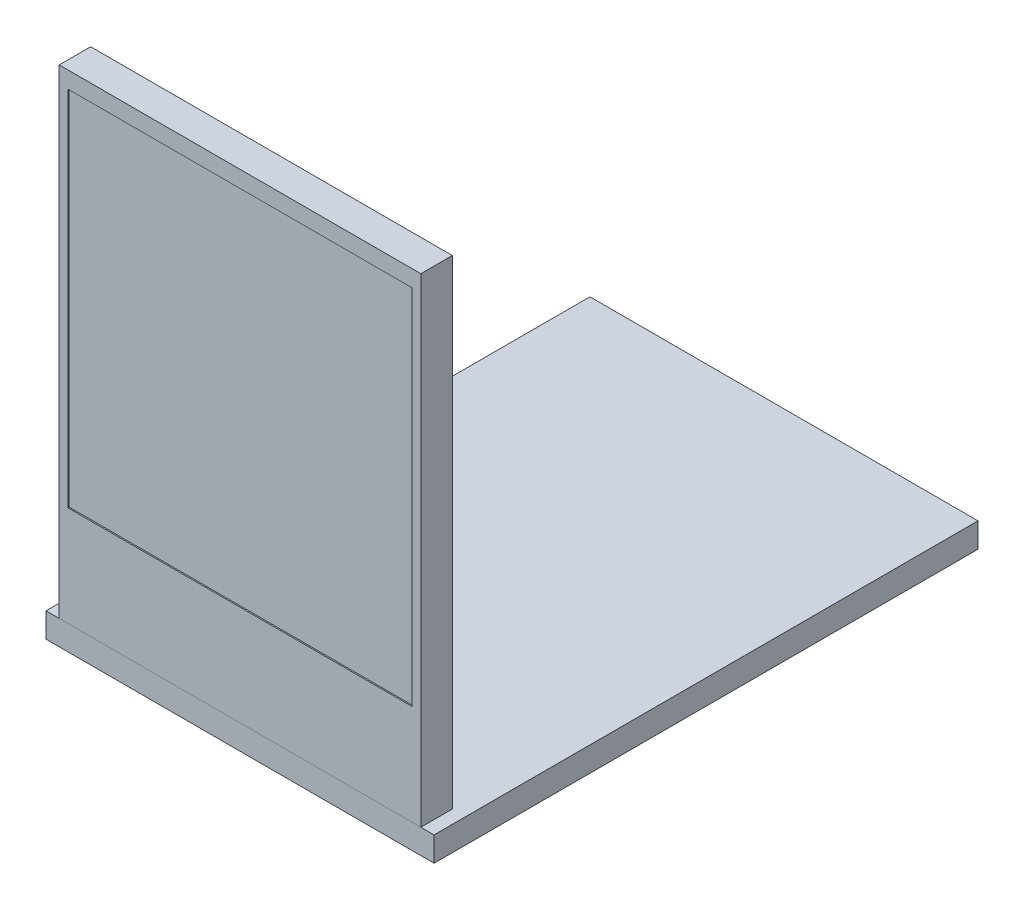
ISO-10303-21;
HEADER;
FILE_DESCRIPTION(('STEP AP214'),'2;1');
FILE_NAME('part.step','',(''),(''),'','','');
FILE_SCHEMA(('AUTOMOTIVE_DESIGN { 1 0 10303 214 1 1 1 1 }'));
ENDSEC;
DATA;
#1=APPLICATION_CONTEXT('core data for automotive mechanical design processes');
#2=APPLICATION_PROTOCOL_DEFINITION('international standard','automotive_design',2000,#1);
#3=PRODUCT_CONTEXT('',#1,'mechanical');
#4=PRODUCT('Part','Part','',(#3));
#5=PRODUCT_RELATED_PRODUCT_CATEGORY('part','',(#4));
#6=PRODUCT_DEFINITION_FORMATION('','',#4);
#7=PRODUCT_DEFINITION_CONTEXT('part definition',#1,'design');
#8=PRODUCT_DEFINITION('design','',#6,#7);
#9=PRODUCT_DEFINITION_SHAPE('','',#8);
#10=(LENGTH_UNIT() NAMED_UNIT(*) SI_UNIT(.MILLI.,.METRE.));
#11=(NAMED_UNIT(*) PLANE_ANGLE_UNIT() SI_UNIT($,.RADIAN.));
#12=(NAMED_UNIT(*) SI_UNIT($,.STERADIAN.) SOLID_ANGLE_UNIT());
#13=UNCERTAINTY_MEASURE_WITH_UNIT(LENGTH_MEASURE(1.E-05),#10,'distance_accuracy_value','');
#14=(GEOMETRIC_REPRESENTATION_CONTEXT(3) GLOBAL_UNCERTAINTY_ASSIGNED_CONTEXT((#13)) GLOBAL_UNIT_ASSIGNED_CONTEXT((#10,
#11,#12)) REPRESENTATION_CONTEXT('',''));
#15=CARTESIAN_POINT('',(0.,0.,0.));
#16=DIRECTION('',(0.,0.,1.));
#17=DIRECTION('',(1.,0.,0.));
#18=AXIS2_PLACEMENT_3D('',#15,#16,#17);
#19=CARTESIAN_POINT('',(14.71,39.,-2.56));
#20=DIRECTION('',(1.,0.,0.));
#21=DIRECTION('',(0.,1.,0.));
#22=AXIS2_PLACEMENT_3D('',#19,#20,#21);
#23=PLANE('',#22);
#24=DIRECTION('',(0.,1.,0.));
#25=VECTOR('',#24,1.);
#26=CARTESIAN_POINT('',(14.71,39.,0.));
#27=LINE('',#26,#25);
#28=CARTESIAN_POINT('',(14.71,0.,0.));
#29=VERTEX_POINT('',#28);
#30=CARTESIAN_POINT('',(14.71,39.,0.));
#31=VERTEX_POINT('',#30);
#32=EDGE_CURVE('E154',#29,#31,#27,.T.);
#33=ORIENTED_EDGE('',*,*,#32,.F.);
#34=DIRECTION('',(0.,0.,1.));
#35=VECTOR('',#34,1.);
#36=CARTESIAN_POINT('',(14.71,0.,-2.56));
#37=LINE('',#36,#35);
#38=CARTESIAN_POINT('',(14.71,0.,-2.56));
#39=VERTEX_POINT('',#38);
#40=EDGE_CURVE('E12',#39,#29,#37,.T.);
#41=ORIENTED_EDGE('',*,*,#40,.F.);
#42=DIRECTION('',(0.,1.,0.));
#43=VECTOR('',#42,1.);
#44=CARTESIAN_POINT('',(14.71,39.,-2.56));
#45=LINE('',#44,#43);
#46=CARTESIAN_POINT('',(14.71,39.,-2.56));
#47=VERTEX_POINT('',#46);
#48=EDGE_CURVE('E158',#39,#47,#45,.T.);
#49=ORIENTED_EDGE('',*,*,#48,.T.);
#50=DIRECTION('',(0.,0.,1.));
#51=VECTOR('',#50,1.);
#52=CARTESIAN_POINT('',(14.71,39.,-2.56));
#53=LINE('',#52,#51);
#54=EDGE_CURVE('E50',#47,#31,#53,.T.);
#55=ORIENTED_EDGE('',*,*,#54,.T.);
#56=EDGE_LOOP('',(#33,#41,#49,#55));
#57=FACE_BOUND('',#56,.T.);
#58=ADVANCED_FACE('F47',(#57),#23,.T.);
#59=CARTESIAN_POINT('',(-14.71,0.,-2.56));
#60=DIRECTION('',(0.,-1.,0.));
#61=DIRECTION('',(1.,0.,0.));
#62=AXIS2_PLACEMENT_3D('',#59,#60,#61);
#63=PLANE('',#62);
#64=DIRECTION('',(1.,0.,0.));
#65=VECTOR('',#64,1.);
#66=CARTESIAN_POINT('',(-14.71,0.,0.));
#67=LINE('',#66,#65);
#68=CARTESIAN_POINT('',(-14.71,0.,0.));
#69=VERTEX_POINT('',#68);
#70=EDGE_CURVE('E161',#69,#29,#67,.T.);
#71=ORIENTED_EDGE('',*,*,#70,.F.);
#72=DIRECTION('',(0.,0.,1.));
#73=VECTOR('',#72,1.);
#74=CARTESIAN_POINT('',(-14.71,0.,-2.56));
#75=LINE('',#74,#73);
#76=CARTESIAN_POINT('',(-14.71,0.,-2.56));
#77=VERTEX_POINT('',#76);
#78=EDGE_CURVE('E55',#77,#69,#75,.T.);
#79=ORIENTED_EDGE('',*,*,#78,.F.);
#80=DIRECTION('',(1.,0.,0.));
#81=VECTOR('',#80,1.);
#82=CARTESIAN_POINT('',(-14.71,0.,-2.56));
#83=LINE('',#82,#81);
#84=EDGE_CURVE('E166',#77,#39,#83,.T.);
#85=ORIENTED_EDGE('',*,*,#84,.T.);
#86=ORIENTED_EDGE('',*,*,#40,.T.);
#87=EDGE_LOOP('',(#71,#79,#85,#86));
#88=FACE_BOUND('',#87,.T.);
#89=ADVANCED_FACE('F183',(#88),#63,.T.);
#90=CARTESIAN_POINT('',(-14.71,39.,-2.56));
#91=DIRECTION('',(-1.,0.,0.));
#92=DIRECTION('',(0.,-1.,0.));
#93=AXIS2_PLACEMENT_3D('',#90,#91,#92);
#94=PLANE('',#93);
#95=DIRECTION('',(0.,-1.,0.));
#96=VECTOR('',#95,1.);
#97=CARTESIAN_POINT('',(-14.71,39.,0.));
#98=LINE('',#97,#96);
#99=CARTESIAN_POINT('',(-14.71,39.,0.));
#100=VERTEX_POINT('',#99);
#101=EDGE_CURVE('E173',#100,#69,#98,.T.);
#102=ORIENTED_EDGE('',*,*,#101,.F.);
#103=DIRECTION('',(0.,0.,1.));
#104=VECTOR('',#103,1.);
#105=CARTESIAN_POINT('',(-14.71,39.,-2.56));
#106=LINE('',#105,#104);
#107=CARTESIAN_POINT('',(-14.71,39.,-2.56));
#108=VERTEX_POINT('',#107);
#109=EDGE_CURVE('E178',#108,#100,#106,.T.);
#110=ORIENTED_EDGE('',*,*,#109,.F.);
#111=DIRECTION('',(0.,-1.,0.));
#112=VECTOR('',#111,1.);
#113=CARTESIAN_POINT('',(-14.71,39.,-2.56));
#114=LINE('',#113,#112);
#115=EDGE_CURVE('E163',#108,#77,#114,.T.);
#116=ORIENTED_EDGE('',*,*,#115,.T.);
#117=ORIENTED_EDGE('',*,*,#78,.T.);
#118=EDGE_LOOP('',(#102,#110,#116,#117));
#119=FACE_BOUND('',#118,.T.);
#120=ADVANCED_FACE('F187',(#119),#94,.T.);
#121=CARTESIAN_POINT('',(-14.71,39.,-2.56));
#122=DIRECTION('',(0.,1.,0.));
#123=DIRECTION('',(0.,0.,1.));
#124=AXIS2_PLACEMENT_3D('',#121,#122,#123);
#125=PLANE('',#124);
#126=DIRECTION('',(-1.,0.,0.));
#127=VECTOR('',#126,1.);
#128=CARTESIAN_POINT('',(-14.71,39.,0.));
#129=LINE('',#128,#127);
#130=EDGE_CURVE('E170',#31,#100,#129,.T.);
#131=ORIENTED_EDGE('',*,*,#130,.F.);
#132=ORIENTED_EDGE('',*,*,#54,.F.);
#133=DIRECTION('',(-1.,0.,0.));
#134=VECTOR('',#133,1.);
#135=CARTESIAN_POINT('',(-14.71,39.,-2.56));
#136=LINE('',#135,#134);
#137=EDGE_CURVE('E160',#47,#108,#136,.T.);
#138=ORIENTED_EDGE('',*,*,#137,.T.);
#139=ORIENTED_EDGE('',*,*,#109,.T.);
#140=EDGE_LOOP('',(#131,#132,#138,#139));
#141=FACE_BOUND('',#140,.T.);
#142=ADVANCED_FACE('F180',(#141),#125,.T.);
#143=CARTESIAN_POINT('',(0.,0.,-2.56));
#144=DIRECTION('',(0.,0.,1.));
#145=DIRECTION('',(1.,0.,0.));
#146=AXIS2_PLACEMENT_3D('',#143,#144,#145);
#147=PLANE('',#146);
#148=ORIENTED_EDGE('',*,*,#48,.F.);
#149=ORIENTED_EDGE('',*,*,#84,.F.);
#150=ORIENTED_EDGE('',*,*,#115,.F.);
#151=ORIENTED_EDGE('',*,*,#137,.F.);
#152=EDGE_LOOP('',(#148,#149,#150,#151));
#153=FACE_BOUND('',#152,.T.);
#154=ADVANCED_FACE('F189',(#153),#147,.F.);
#155=CARTESIAN_POINT('',(0.,0.,0.));
#156=DIRECTION('',(0.,0.,1.));
#157=DIRECTION('',(1.,0.,0.));
#158=AXIS2_PLACEMENT_3D('',#155,#156,#157);
#159=PLANE('',#158);
#160=DIRECTION('',(0.,1.,0.));
#161=VECTOR('',#160,1.);
#162=CARTESIAN_POINT('',(14.,37.65,0.));
#163=LINE('',#162,#161);
#164=CARTESIAN_POINT('',(14.,8.15,0.));
#165=VERTEX_POINT('',#164);
#166=CARTESIAN_POINT('',(14.,37.65,0.));
#167=VERTEX_POINT('',#166);
#168=EDGE_CURVE('E63',#165,#167,#163,.T.);
#169=ORIENTED_EDGE('',*,*,#168,.F.);
#170=DIRECTION('',(1.,0.,0.));
#171=VECTOR('',#170,1.);
#172=CARTESIAN_POINT('',(-14.,8.15,0.));
#173=LINE('',#172,#171);
#174=CARTESIAN_POINT('',(-14.,8.15,0.));
#175=VERTEX_POINT('',#174);
#176=EDGE_CURVE('E139',#175,#165,#173,.T.);
#177=ORIENTED_EDGE('',*,*,#176,.F.);
#178=DIRECTION('',(0.,-1.,0.));
#179=VECTOR('',#178,1.);
#180=CARTESIAN_POINT('',(-14.,37.65,0.));
#181=LINE('',#180,#179);
#182=CARTESIAN_POINT('',(-14.,37.65,0.));
#183=VERTEX_POINT('',#182);
#184=EDGE_CURVE('E142',#183,#175,#181,.T.);
#185=ORIENTED_EDGE('',*,*,#184,.F.);
#186=DIRECTION('',(-1.,0.,0.));
#187=VECTOR('',#186,1.);
#188=CARTESIAN_POINT('',(-14.,37.65,0.));
#189=LINE('',#188,#187);
#190=EDGE_CURVE('E148',#167,#183,#189,.T.);
#191=ORIENTED_EDGE('',*,*,#190,.F.);
#192=EDGE_LOOP('',(#169,#177,#185,#191));
#193=FACE_BOUND('',#192,.T.);
#194=ORIENTED_EDGE('',*,*,#32,.T.);
#195=ORIENTED_EDGE('',*,*,#130,.T.);
#196=ORIENTED_EDGE('',*,*,#101,.T.);
#197=ORIENTED_EDGE('',*,*,#70,.T.);
#198=EDGE_LOOP('',(#194,#195,#196,#197));
#199=FACE_BOUND('',#198,.T.);
#200=ADVANCED_FACE('F182',(#193,#199),#159,.T.);
#201=CARTESIAN_POINT('',(14.,37.65,-0.1));
#202=DIRECTION('',(1.,0.,0.));
#203=DIRECTION('',(0.,1.,0.));
#204=AXIS2_PLACEMENT_3D('',#201,#202,#203);
#205=PLANE('',#204);
#206=ORIENTED_EDGE('',*,*,#168,.T.);
#207=DIRECTION('',(0.,0.,1.));
#208=VECTOR('',#207,1.);
#209=CARTESIAN_POINT('',(14.,37.65,-0.1));
#210=LINE('',#209,#208);
#211=CARTESIAN_POINT('',(14.,37.65,-0.1));
#212=VERTEX_POINT('',#211);
#213=EDGE_CURVE('E117',#212,#167,#210,.T.);
#214=ORIENTED_EDGE('',*,*,#213,.F.);
#215=DIRECTION('',(0.,1.,0.));
#216=VECTOR('',#215,1.);
#217=CARTESIAN_POINT('',(14.,37.65,-0.1));
#218=LINE('',#217,#216);
#219=CARTESIAN_POINT('',(14.,8.15,-0.1));
#220=VERTEX_POINT('',#219);
#221=EDGE_CURVE('E121',#220,#212,#218,.T.);
#222=ORIENTED_EDGE('',*,*,#221,.F.);
#223=DIRECTION('',(0.,0.,1.));
#224=VECTOR('',#223,1.);
#225=CARTESIAN_POINT('',(14.,8.15,-0.1));
#226=LINE('',#225,#224);
#227=EDGE_CURVE('E152',#220,#165,#226,.T.);
#228=ORIENTED_EDGE('',*,*,#227,.T.);
#229=EDGE_LOOP('',(#206,#214,#222,#228));
#230=FACE_BOUND('',#229,.T.);
#231=ADVANCED_FACE('F119',(#230),#205,.F.);
#232=CARTESIAN_POINT('',(-14.,8.15,-0.1));
#233=DIRECTION('',(0.,-1.,0.));
#234=DIRECTION('',(0.,0.,-1.));
#235=AXIS2_PLACEMENT_3D('',#232,#233,#234);
#236=PLANE('',#235);
#237=ORIENTED_EDGE('',*,*,#176,.T.);
#238=ORIENTED_EDGE('',*,*,#227,.F.);
#239=DIRECTION('',(1.,0.,0.));
#240=VECTOR('',#239,1.);
#241=CARTESIAN_POINT('',(-14.,8.15,-0.1));
#242=LINE('',#241,#240);
#243=CARTESIAN_POINT('',(-14.,8.15,-0.1));
#244=VERTEX_POINT('',#243);
#245=EDGE_CURVE('E127',#244,#220,#242,.T.);
#246=ORIENTED_EDGE('',*,*,#245,.F.);
#247=DIRECTION('',(0.,0.,1.));
#248=VECTOR('',#247,1.);
#249=CARTESIAN_POINT('',(-14.,8.15,-0.1));
#250=LINE('',#249,#248);
#251=EDGE_CURVE('E155',#244,#175,#250,.T.);
#252=ORIENTED_EDGE('',*,*,#251,.T.);
#253=EDGE_LOOP('',(#237,#238,#246,#252));
#254=FACE_BOUND('',#253,.T.);
#255=ADVANCED_FACE('F233',(#254),#236,.F.);
#256=CARTESIAN_POINT('',(-14.,37.65,-0.1));
#257=DIRECTION('',(-1.,0.,0.));
#258=DIRECTION('',(0.,-1.,0.));
#259=AXIS2_PLACEMENT_3D('',#256,#257,#258);
#260=PLANE('',#259);
#261=ORIENTED_EDGE('',*,*,#184,.T.);
#262=ORIENTED_EDGE('',*,*,#251,.F.);
#263=DIRECTION('',(0.,-1.,0.));
#264=VECTOR('',#263,1.);
#265=CARTESIAN_POINT('',(-14.,37.65,-0.1));
#266=LINE('',#265,#264);
#267=CARTESIAN_POINT('',(-14.,37.65,-0.1));
#268=VERTEX_POINT('',#267);
#269=EDGE_CURVE('E135',#268,#244,#266,.T.);
#270=ORIENTED_EDGE('',*,*,#269,.F.);
#271=DIRECTION('',(0.,0.,1.));
#272=VECTOR('',#271,1.);
#273=CARTESIAN_POINT('',(-14.,37.65,-0.1));
#274=LINE('',#273,#272);
#275=EDGE_CURVE('E126',#268,#183,#274,.T.);
#276=ORIENTED_EDGE('',*,*,#275,.T.);
#277=EDGE_LOOP('',(#261,#262,#270,#276));
#278=FACE_BOUND('',#277,.T.);
#279=ADVANCED_FACE('F241',(#278),#260,.F.);
#280=CARTESIAN_POINT('',(-14.,37.65,-0.1));
#281=DIRECTION('',(0.,1.,0.));
#282=DIRECTION('',(0.,0.,1.));
#283=AXIS2_PLACEMENT_3D('',#280,#281,#282);
#284=PLANE('',#283);
#285=ORIENTED_EDGE('',*,*,#190,.T.);
#286=ORIENTED_EDGE('',*,*,#275,.F.);
#287=DIRECTION('',(-1.,0.,0.));
#288=VECTOR('',#287,1.);
#289=CARTESIAN_POINT('',(-14.,37.65,-0.1));
#290=LINE('',#289,#288);
#291=EDGE_CURVE('E130',#212,#268,#290,.T.);
#292=ORIENTED_EDGE('',*,*,#291,.F.);
#293=ORIENTED_EDGE('',*,*,#213,.T.);
#294=EDGE_LOOP('',(#285,#286,#292,#293));
#295=FACE_BOUND('',#294,.T.);
#296=ADVANCED_FACE('F131',(#295),#284,.F.);
#297=CARTESIAN_POINT('',(0.,0.,-0.1));
#298=DIRECTION('',(0.,0.,1.));
#299=DIRECTION('',(1.,0.,0.));
#300=AXIS2_PLACEMENT_3D('',#297,#298,#299);
#301=PLANE('',#300);
#302=ORIENTED_EDGE('',*,*,#221,.T.);
#303=ORIENTED_EDGE('',*,*,#291,.T.);
#304=ORIENTED_EDGE('',*,*,#269,.T.);
#305=ORIENTED_EDGE('',*,*,#245,.T.);
#306=EDGE_LOOP('',(#302,#303,#304,#305));
#307=FACE_BOUND('',#306,.T.);
#308=ADVANCED_FACE('F137',(#307),#301,.T.);
#309=CLOSED_SHELL('',(#58,#89,#120,#142,#154,#200,#231,#255,#279,#296,#308));
#310=MANIFOLD_SOLID_BREP('B2',#309);
#311=CARTESIAN_POINT('',(15.785,-2.,-44.25));
#312=DIRECTION('',(1.,0.,0.));
#313=DIRECTION('',(0.,0.,-1.));
#314=AXIS2_PLACEMENT_3D('',#311,#312,#313);
#315=PLANE('',#314);
#316=DIRECTION('',(0.,0.,-1.));
#317=VECTOR('',#316,1.);
#318=CARTESIAN_POINT('',(15.785,0.,-44.25));
#319=LINE('',#318,#317);
#320=CARTESIAN_POINT('',(15.785,0.,0.));
#321=VERTEX_POINT('',#320);
#322=CARTESIAN_POINT('',(15.785,0.,-44.25));
#323=VERTEX_POINT('',#322);
#324=EDGE_CURVE('E350',#321,#323,#319,.T.);
#325=ORIENTED_EDGE('',*,*,#324,.F.);
#326=DIRECTION('',(0.,1.,0.));
#327=VECTOR('',#326,1.);
#328=CARTESIAN_POINT('',(15.785,-2.,0.));
#329=LINE('',#328,#327);
#330=CARTESIAN_POINT('',(15.785,-2.,0.));
#331=VERTEX_POINT('',#330);
#332=EDGE_CURVE('E45',#331,#321,#329,.T.);
#333=ORIENTED_EDGE('',*,*,#332,.F.);
#334=DIRECTION('',(0.,0.,-1.));
#335=VECTOR('',#334,1.);
#336=CARTESIAN_POINT('',(15.785,-2.,-44.25));
#337=LINE('',#336,#335);
#338=CARTESIAN_POINT('',(15.785,-2.,-44.25));
#339=VERTEX_POINT('',#338);
#340=EDGE_CURVE('E344',#331,#339,#337,.T.);
#341=ORIENTED_EDGE('',*,*,#340,.T.);
#342=DIRECTION('',(0.,1.,0.));
#343=VECTOR('',#342,1.);
#344=CARTESIAN_POINT('',(15.785,-2.,-44.25));
#345=LINE('',#344,#343);
#346=EDGE_CURVE('E289',#339,#323,#345,.T.);
#347=ORIENTED_EDGE('',*,*,#346,.T.);
#348=EDGE_LOOP('',(#325,#333,#341,#347));
#349=FACE_BOUND('',#348,.T.);
#350=ADVANCED_FACE('F286',(#349),#315,.T.);
#351=CARTESIAN_POINT('',(-15.785,-2.,0.));
#352=DIRECTION('',(0.,0.,1.));
#353=DIRECTION('',(1.,0.,0.));
#354=AXIS2_PLACEMENT_3D('',#351,#352,#353);
#355=PLANE('',#354);
#356=DIRECTION('',(1.,0.,0.));
#357=VECTOR('',#356,1.);
#358=CARTESIAN_POINT('',(-15.785,0.,0.));
#359=LINE('',#358,#357);
#360=CARTESIAN_POINT('',(-15.785,0.,0.));
#361=VERTEX_POINT('',#360);
#362=EDGE_CURVE('E346',#361,#321,#359,.T.);
#363=ORIENTED_EDGE('',*,*,#362,.F.);
#364=DIRECTION('',(0.,1.,0.));
#365=VECTOR('',#364,1.);
#366=CARTESIAN_POINT('',(-15.785,-2.,0.));
#367=LINE('',#366,#365);
#368=CARTESIAN_POINT('',(-15.785,-2.,0.));
#369=VERTEX_POINT('',#368);
#370=EDGE_CURVE('E295',#369,#361,#367,.T.);
#371=ORIENTED_EDGE('',*,*,#370,.F.);
#372=DIRECTION('',(1.,0.,0.));
#373=VECTOR('',#372,1.);
#374=CARTESIAN_POINT('',(-15.785,-2.,0.));
#375=LINE('',#374,#373);
#376=EDGE_CURVE('E341',#369,#331,#375,.T.);
#377=ORIENTED_EDGE('',*,*,#376,.T.);
#378=ORIENTED_EDGE('',*,*,#332,.T.);
#379=EDGE_LOOP('',(#363,#371,#377,#378));
#380=FACE_BOUND('',#379,.T.);
#381=ADVANCED_FACE('F360',(#380),#355,.T.);
#382=CARTESIAN_POINT('',(-15.785,-2.,-44.25));
#383=DIRECTION('',(-1.,0.,0.));
#384=DIRECTION('',(0.,0.,1.));
#385=AXIS2_PLACEMENT_3D('',#382,#383,#384);
#386=PLANE('',#385);
#387=DIRECTION('',(0.,0.,1.));
#388=VECTOR('',#387,1.);
#389=CARTESIAN_POINT('',(-15.785,0.,-44.25));
#390=LINE('',#389,#388);
#391=CARTESIAN_POINT('',(-15.785,0.,-44.25));
#392=VERTEX_POINT('',#391);
#393=EDGE_CURVE('E336',#392,#361,#390,.T.);
#394=ORIENTED_EDGE('',*,*,#393,.F.);
#395=DIRECTION('',(0.,1.,0.));
#396=VECTOR('',#395,1.);
#397=CARTESIAN_POINT('',(-15.785,-2.,-44.25));
#398=LINE('',#397,#396);
#399=CARTESIAN_POINT('',(-15.785,-2.,-44.25));
#400=VERTEX_POINT('',#399);
#401=EDGE_CURVE('E331',#400,#392,#398,.T.);
#402=ORIENTED_EDGE('',*,*,#401,.F.);
#403=DIRECTION('',(0.,0.,1.));
#404=VECTOR('',#403,1.);
#405=CARTESIAN_POINT('',(-15.785,-2.,-44.25));
#406=LINE('',#405,#404);
#407=EDGE_CURVE('E334',#400,#369,#406,.T.);
#408=ORIENTED_EDGE('',*,*,#407,.T.);
#409=ORIENTED_EDGE('',*,*,#370,.T.);
#410=EDGE_LOOP('',(#394,#402,#408,#409));
#411=FACE_BOUND('',#410,.T.);
#412=ADVANCED_FACE('F333',(#411),#386,.T.);
#413=CARTESIAN_POINT('',(-15.785,-2.,-44.25));
#414=DIRECTION('',(0.,0.,-1.));
#415=DIRECTION('',(-1.,0.,0.));
#416=AXIS2_PLACEMENT_3D('',#413,#414,#415);
#417=PLANE('',#416);
#418=DIRECTION('',(-1.,0.,0.));
#419=VECTOR('',#418,1.);
#420=CARTESIAN_POINT('',(-15.785,0.,-44.25));
#421=LINE('',#420,#419);
#422=EDGE_CURVE('E353',#323,#392,#421,.T.);
#423=ORIENTED_EDGE('',*,*,#422,.F.);
#424=ORIENTED_EDGE('',*,*,#346,.F.);
#425=DIRECTION('',(-1.,0.,0.));
#426=VECTOR('',#425,1.);
#427=CARTESIAN_POINT('',(-15.785,-2.,-44.25));
#428=LINE('',#427,#426);
#429=EDGE_CURVE('E340',#339,#400,#428,.T.);
#430=ORIENTED_EDGE('',*,*,#429,.T.);
#431=ORIENTED_EDGE('',*,*,#401,.T.);
#432=EDGE_LOOP('',(#423,#424,#430,#431));
#433=FACE_BOUND('',#432,.T.);
#434=ADVANCED_FACE('F343',(#433),#417,.T.);
#435=CARTESIAN_POINT('',(0.,-2.,0.));
#436=DIRECTION('',(0.,1.,0.));
#437=DIRECTION('',(0.,0.,1.));
#438=AXIS2_PLACEMENT_3D('',#435,#436,#437);
#439=PLANE('',#438);
#440=ORIENTED_EDGE('',*,*,#340,.F.);
#441=ORIENTED_EDGE('',*,*,#376,.F.);
#442=ORIENTED_EDGE('',*,*,#407,.F.);
#443=ORIENTED_EDGE('',*,*,#429,.F.);
#444=EDGE_LOOP('',(#440,#441,#442,#443));
#445=FACE_BOUND('',#444,.T.);
#446=ADVANCED_FACE('F339',(#445),#439,.F.);
#447=CARTESIAN_POINT('',(0.,0.,0.));
#448=DIRECTION('',(0.,1.,0.));
#449=DIRECTION('',(0.,0.,1.));
#450=AXIS2_PLACEMENT_3D('',#447,#448,#449);
#451=PLANE('',#450);
#452=ORIENTED_EDGE('',*,*,#324,.T.);
#453=ORIENTED_EDGE('',*,*,#422,.T.);
#454=ORIENTED_EDGE('',*,*,#393,.T.);
#455=ORIENTED_EDGE('',*,*,#362,.T.);
#456=EDGE_LOOP('',(#452,#453,#454,#455));
#457=FACE_BOUND('',#456,.T.);
#458=ADVANCED_FACE('F359',(#457),#451,.T.);
#459=CLOSED_SHELL('',(#350,#381,#412,#434,#446,#458));
#460=MANIFOLD_SOLID_BREP('B6',#459);
#461=ADVANCED_BREP_SHAPE_REPRESENTATION('',(#18,#310,#460),#14);
#462=SHAPE_DEFINITION_REPRESENTATION(#9,#461);
ENDSEC;
END-ISO-10303-21;
